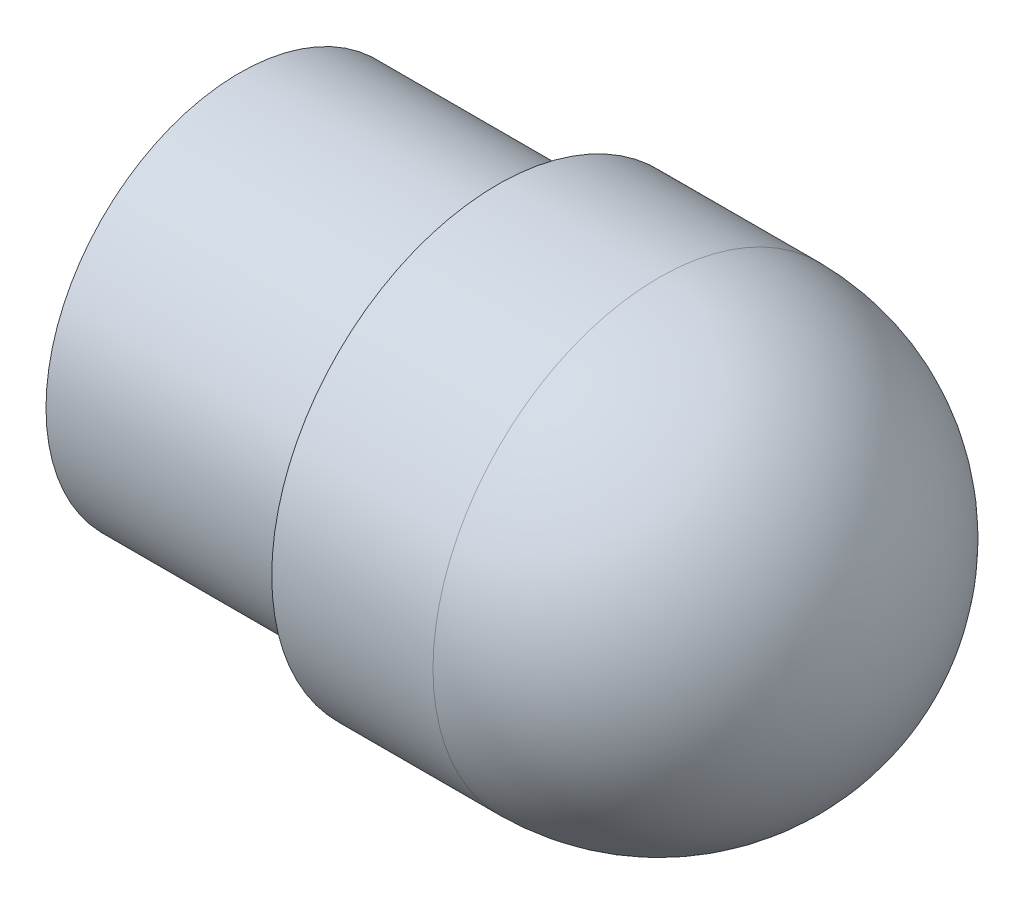
ISO-10303-21;
HEADER;
FILE_DESCRIPTION(('STEP AP214'),'2;1');
FILE_NAME('part.step','',(''),(''),'','','');
FILE_SCHEMA(('AUTOMOTIVE_DESIGN { 1 0 10303 214 1 1 1 1 }'));
ENDSEC;
DATA;
#1=APPLICATION_CONTEXT('core data for automotive mechanical design processes');
#2=APPLICATION_PROTOCOL_DEFINITION('international standard','automotive_design',2000,#1);
#3=PRODUCT_CONTEXT('',#1,'mechanical');
#4=PRODUCT('Part','Part','',(#3));
#5=PRODUCT_RELATED_PRODUCT_CATEGORY('part','',(#4));
#6=PRODUCT_DEFINITION_FORMATION('','',#4);
#7=PRODUCT_DEFINITION_CONTEXT('part definition',#1,'design');
#8=PRODUCT_DEFINITION('design','',#6,#7);
#9=PRODUCT_DEFINITION_SHAPE('','',#8);
#10=(LENGTH_UNIT() NAMED_UNIT(*) SI_UNIT(.MILLI.,.METRE.));
#11=(NAMED_UNIT(*) PLANE_ANGLE_UNIT() SI_UNIT($,.RADIAN.));
#12=(NAMED_UNIT(*) SI_UNIT($,.STERADIAN.) SOLID_ANGLE_UNIT());
#13=UNCERTAINTY_MEASURE_WITH_UNIT(LENGTH_MEASURE(1.E-05),#10,'distance_accuracy_value','');
#14=(GEOMETRIC_REPRESENTATION_CONTEXT(3) GLOBAL_UNCERTAINTY_ASSIGNED_CONTEXT((#13)) GLOBAL_UNIT_ASSIGNED_CONTEXT((#10,
#11,#12)) REPRESENTATION_CONTEXT('',''));
#15=CARTESIAN_POINT('',(0.,0.,0.));
#16=DIRECTION('',(0.,0.,1.));
#17=DIRECTION('',(1.,0.,0.));
#18=AXIS2_PLACEMENT_3D('',#15,#16,#17);
#19=CARTESIAN_POINT('',(0.,0.,0.));
#20=DIRECTION('',(-1.,0.,0.));
#21=DIRECTION('',(0.,0.,1.));
#22=AXIS2_PLACEMENT_3D('',#19,#20,#21);
#23=PLANE('',#22);
#24=CARTESIAN_POINT('',(0.,0.,0.));
#25=DIRECTION('',(-1.,0.,0.));
#26=DIRECTION('',(0.,0.,1.));
#27=AXIS2_PLACEMENT_3D('',#24,#25,#26);
#28=CIRCLE('',#27,15.);
#29=CARTESIAN_POINT('',(0.,0.,15.));
#30=VERTEX_POINT('',#29);
#31=EDGE_CURVE('E10',#30,#30,#28,.T.);
#32=ORIENTED_EDGE('',*,*,#31,.T.);
#33=EDGE_LOOP('',(#32));
#34=FACE_BOUND('',#33,.T.);
#35=ADVANCED_FACE('F37',(#34),#23,.T.);
#36=CARTESIAN_POINT('',(0.,0.,0.));
#37=DIRECTION('',(-1.,0.,0.));
#38=DIRECTION('',(0.,0.,1.));
#39=AXIS2_PLACEMENT_3D('',#36,#37,#38);
#40=CYLINDRICAL_SURFACE('',#39,15.);
#41=CARTESIAN_POINT('',(20.,0.,0.));
#42=DIRECTION('',(-1.,0.,0.));
#43=DIRECTION('',(0.,0.,1.));
#44=AXIS2_PLACEMENT_3D('',#41,#42,#43);
#45=CIRCLE('',#44,15.);
#46=CARTESIAN_POINT('',(20.,0.,15.));
#47=VERTEX_POINT('',#46);
#48=EDGE_CURVE('E44',#47,#47,#45,.T.);
#49=ORIENTED_EDGE('',*,*,#48,.T.);
#50=EDGE_LOOP('',(#49));
#51=FACE_BOUND('',#50,.T.);
#52=ORIENTED_EDGE('',*,*,#31,.F.);
#53=EDGE_LOOP('',(#52));
#54=FACE_BOUND('',#53,.T.);
#55=ADVANCED_FACE('F73',(#51,#54),#40,.T.);
#56=CARTESIAN_POINT('',(20.,15.,0.));
#57=DIRECTION('',(-1.,0.,0.));
#58=DIRECTION('',(0.,0.,1.));
#59=AXIS2_PLACEMENT_3D('',#56,#57,#58);
#60=PLANE('',#59);
#61=CARTESIAN_POINT('',(20.,0.,0.));
#62=DIRECTION('',(-1.,0.,0.));
#63=DIRECTION('',(0.,0.,1.));
#64=AXIS2_PLACEMENT_3D('',#61,#62,#63);
#65=CIRCLE('',#64,17.5);
#66=CARTESIAN_POINT('',(20.,0.,17.5));
#67=VERTEX_POINT('',#66);
#68=EDGE_CURVE('E49',#67,#67,#65,.T.);
#69=ORIENTED_EDGE('',*,*,#68,.T.);
#70=EDGE_LOOP('',(#69));
#71=FACE_BOUND('',#70,.T.);
#72=ORIENTED_EDGE('',*,*,#48,.F.);
#73=EDGE_LOOP('',(#72));
#74=FACE_BOUND('',#73,.T.);
#75=ADVANCED_FACE('F70',(#71,#74),#60,.T.);
#76=CARTESIAN_POINT('',(0.,0.,0.));
#77=DIRECTION('',(-1.,0.,0.));
#78=DIRECTION('',(0.,0.,1.));
#79=AXIS2_PLACEMENT_3D('',#76,#77,#78);
#80=CYLINDRICAL_SURFACE('',#79,17.5);
#81=CARTESIAN_POINT('',(32.5,0.,0.));
#82=DIRECTION('',(-1.,0.,0.));
#83=DIRECTION('',(0.,0.,1.));
#84=AXIS2_PLACEMENT_3D('',#81,#82,#83);
#85=CIRCLE('',#84,17.5);
#86=CARTESIAN_POINT('',(32.5,0.,17.5));
#87=VERTEX_POINT('',#86);
#88=EDGE_CURVE('E54',#87,#87,#85,.T.);
#89=ORIENTED_EDGE('',*,*,#88,.T.);
#90=EDGE_LOOP('',(#89));
#91=FACE_BOUND('',#90,.T.);
#92=ORIENTED_EDGE('',*,*,#68,.F.);
#93=EDGE_LOOP('',(#92));
#94=FACE_BOUND('',#93,.T.);
#95=ADVANCED_FACE('F61',(#91,#94),#80,.T.);
#96=CARTESIAN_POINT('',(32.5,0.,0.));
#97=DIRECTION('',(-1.,0.,0.));
#98=DIRECTION('',(0.,1.,0.));
#99=AXIS2_PLACEMENT_3D('',#96,#97,#98);
#100=SPHERICAL_SURFACE('',#99,17.5);
#101=ORIENTED_EDGE('',*,*,#88,.F.);
#102=EDGE_LOOP('',(#101));
#103=FACE_BOUND('',#102,.T.);
#104=ADVANCED_FACE('F64',(#103),#100,.T.);
#105=CLOSED_SHELL('',(#35,#55,#75,#95,#104));
#106=MANIFOLD_SOLID_BREP('B2',#105);
#107=ADVANCED_BREP_SHAPE_REPRESENTATION('',(#18,#106),#14);
#108=SHAPE_DEFINITION_REPRESENTATION(#9,#107);
ENDSEC;
END-ISO-10303-21;
